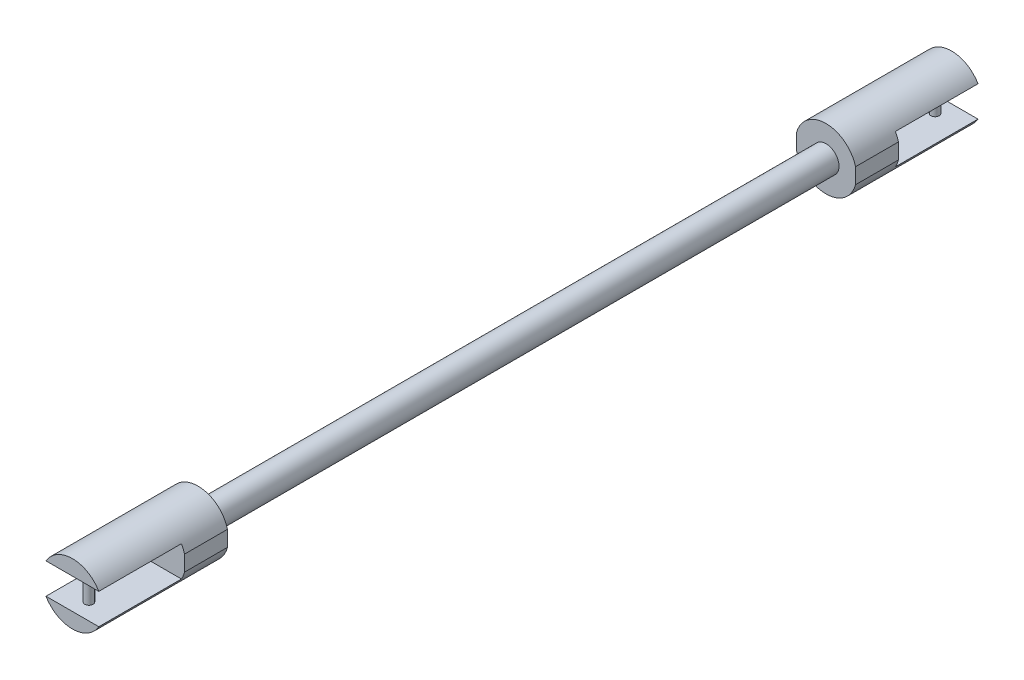
ISO-10303-21;
HEADER;
FILE_DESCRIPTION(('STEP AP214'),'2;1');
FILE_NAME('part.step','',(''),(''),'','','');
FILE_SCHEMA(('AUTOMOTIVE_DESIGN { 1 0 10303 214 1 1 1 1 }'));
ENDSEC;
DATA;
#1=APPLICATION_CONTEXT('core data for automotive mechanical design processes');
#2=APPLICATION_PROTOCOL_DEFINITION('international standard','automotive_design',2000,#1);
#3=PRODUCT_CONTEXT('',#1,'mechanical');
#4=PRODUCT('Part','Part','',(#3));
#5=PRODUCT_RELATED_PRODUCT_CATEGORY('part','',(#4));
#6=PRODUCT_DEFINITION_FORMATION('','',#4);
#7=PRODUCT_DEFINITION_CONTEXT('part definition',#1,'design');
#8=PRODUCT_DEFINITION('design','',#6,#7);
#9=PRODUCT_DEFINITION_SHAPE('','',#8);
#10=(LENGTH_UNIT() NAMED_UNIT(*) SI_UNIT(.MILLI.,.METRE.));
#11=(NAMED_UNIT(*) PLANE_ANGLE_UNIT() SI_UNIT($,.RADIAN.));
#12=(NAMED_UNIT(*) SI_UNIT($,.STERADIAN.) SOLID_ANGLE_UNIT());
#13=UNCERTAINTY_MEASURE_WITH_UNIT(LENGTH_MEASURE(1.E-05),#10,'distance_accuracy_value','');
#14=(GEOMETRIC_REPRESENTATION_CONTEXT(3) GLOBAL_UNCERTAINTY_ASSIGNED_CONTEXT((#13)) GLOBAL_UNIT_ASSIGNED_CONTEXT((#10,
#11,#12)) REPRESENTATION_CONTEXT('',''));
#15=CARTESIAN_POINT('',(0.,0.,0.));
#16=DIRECTION('',(0.,0.,1.));
#17=DIRECTION('',(1.,0.,0.));
#18=AXIS2_PLACEMENT_3D('',#15,#16,#17);
#19=CARTESIAN_POINT('',(0.,0.,-54.864));
#20=DIRECTION('',(0.,0.,-1.));
#21=DIRECTION('',(1.,0.,0.));
#22=AXIS2_PLACEMENT_3D('',#19,#20,#21);
#23=PLANE('',#22);
#24=CARTESIAN_POINT('',(0.,0.,-54.864));
#25=DIRECTION('',(0.,0.,-1.));
#26=DIRECTION('',(-1.,0.,0.));
#27=AXIS2_PLACEMENT_3D('',#24,#25,#26);
#28=CIRCLE('',#27,4.68995455906906);
#29=CARTESIAN_POINT('',(-4.53418049750098,-1.19869970476948,-54.864));
#30=VERTEX_POINT('',#29);
#31=CARTESIAN_POINT('',(-4.05807772117794,-2.35110165135666,-54.864));
#32=VERTEX_POINT('',#31);
#33=EDGE_CURVE('E295',#30,#32,#28,.F.);
#34=ORIENTED_EDGE('',*,*,#33,.F.);
#35=DIRECTION('',(0.,-1.,0.));
#36=VECTOR('',#35,1.);
#37=CARTESIAN_POINT('',(-4.53418049750098,-4.68995455906906,-54.864));
#38=LINE('',#37,#36);
#39=CARTESIAN_POINT('',(-4.53418049750098,1.19869970476948,-54.864));
#40=VERTEX_POINT('',#39);
#41=EDGE_CURVE('E193',#40,#30,#38,.T.);
#42=ORIENTED_EDGE('',*,*,#41,.F.);
#43=CARTESIAN_POINT('',(-4.05807772117794,2.35110165135666,-54.864));
#44=VERTEX_POINT('',#43);
#45=EDGE_CURVE('E290',#44,#40,#28,.F.);
#46=ORIENTED_EDGE('',*,*,#45,.F.);
#47=DIRECTION('',(1.,0.,0.));
#48=VECTOR('',#47,1.);
#49=CARTESIAN_POINT('',(-4.53418049750098,2.35110165135666,-54.864));
#50=LINE('',#49,#48);
#51=CARTESIAN_POINT('',(4.05807772117794,2.35110165135666,-54.864));
#52=VERTEX_POINT('',#51);
#53=EDGE_CURVE('E172',#44,#52,#50,.T.);
#54=ORIENTED_EDGE('',*,*,#53,.T.);
#55=CARTESIAN_POINT('',(4.53418049750098,1.19869970476948,-54.864));
#56=VERTEX_POINT('',#55);
#57=EDGE_CURVE('E163',#56,#52,#28,.F.);
#58=ORIENTED_EDGE('',*,*,#57,.F.);
#59=DIRECTION('',(0.,1.,0.));
#60=VECTOR('',#59,1.);
#61=CARTESIAN_POINT('',(4.53418049750098,-4.68995455906906,-54.864));
#62=LINE('',#61,#60);
#63=CARTESIAN_POINT('',(4.53418049750098,-1.19869970476948,-54.864));
#64=VERTEX_POINT('',#63);
#65=EDGE_CURVE('E190',#64,#56,#62,.T.);
#66=ORIENTED_EDGE('',*,*,#65,.F.);
#67=CARTESIAN_POINT('',(4.05807772117794,-2.35110165135666,-54.864));
#68=VERTEX_POINT('',#67);
#69=EDGE_CURVE('E283',#68,#64,#28,.F.);
#70=ORIENTED_EDGE('',*,*,#69,.F.);
#71=DIRECTION('',(1.,0.,0.));
#72=VECTOR('',#71,1.);
#73=CARTESIAN_POINT('',(-4.53418049750098,-2.35110165135666,-54.864));
#74=LINE('',#73,#72);
#75=EDGE_CURVE('E181',#32,#68,#74,.T.);
#76=ORIENTED_EDGE('',*,*,#75,.F.);
#77=EDGE_LOOP('',(#34,#42,#46,#54,#58,#66,#70,#76));
#78=FACE_BOUND('',#77,.T.);
#79=ADVANCED_FACE('F37',(#78),#23,.T.);
#80=CARTESIAN_POINT('',(0.,0.,-48.26));
#81=DIRECTION('',(0.,0.,-1.));
#82=DIRECTION('',(1.,0.,0.));
#83=AXIS2_PLACEMENT_3D('',#80,#81,#82);
#84=PLANE('',#83);
#85=CARTESIAN_POINT('',(0.,0.,-48.26));
#86=DIRECTION('',(0.,0.,-1.));
#87=DIRECTION('',(-1.,0.,0.));
#88=AXIS2_PLACEMENT_3D('',#85,#86,#87);
#89=CIRCLE('',#88,2.);
#90=CARTESIAN_POINT('',(-2.,0.,-48.26));
#91=VERTEX_POINT('',#90);
#92=EDGE_CURVE('E192',#91,#91,#89,.T.);
#93=ORIENTED_EDGE('',*,*,#92,.T.);
#94=EDGE_LOOP('',(#93));
#95=FACE_BOUND('',#94,.T.);
#96=DIRECTION('',(0.,-1.,0.));
#97=VECTOR('',#96,1.);
#98=CARTESIAN_POINT('',(-4.53418049750098,-4.68995455906906,-48.26));
#99=LINE('',#98,#97);
#100=CARTESIAN_POINT('',(-4.53418049750098,1.19869970476948,-48.26));
#101=VERTEX_POINT('',#100);
#102=CARTESIAN_POINT('',(-4.53418049750098,-1.19869970476948,-48.26));
#103=VERTEX_POINT('',#102);
#104=EDGE_CURVE('E171',#101,#103,#99,.T.);
#105=ORIENTED_EDGE('',*,*,#104,.T.);
#106=CARTESIAN_POINT('',(0.,0.,-48.26));
#107=DIRECTION('',(0.,0.,-1.));
#108=DIRECTION('',(-1.,0.,0.));
#109=AXIS2_PLACEMENT_3D('',#106,#107,#108);
#110=CIRCLE('',#109,4.68995455906906);
#111=CARTESIAN_POINT('',(4.53418049750098,-1.19869970476948,-48.26));
#112=VERTEX_POINT('',#111);
#113=EDGE_CURVE('E298',#103,#112,#110,.F.);
#114=ORIENTED_EDGE('',*,*,#113,.T.);
#115=DIRECTION('',(0.,1.,0.));
#116=VECTOR('',#115,1.);
#117=CARTESIAN_POINT('',(4.53418049750098,-4.68995455906906,-48.26));
#118=LINE('',#117,#116);
#119=CARTESIAN_POINT('',(4.53418049750098,1.19869970476948,-48.26));
#120=VERTEX_POINT('',#119);
#121=EDGE_CURVE('E175',#112,#120,#118,.T.);
#122=ORIENTED_EDGE('',*,*,#121,.T.);
#123=EDGE_CURVE('E286',#120,#101,#110,.F.);
#124=ORIENTED_EDGE('',*,*,#123,.T.);
#125=EDGE_LOOP('',(#105,#114,#122,#124));
#126=FACE_BOUND('',#125,.T.);
#127=ADVANCED_FACE('F328',(#95,#126),#84,.F.);
#128=CARTESIAN_POINT('',(0.,0.,-67.564));
#129=DIRECTION('',(0.,0.,-1.));
#130=DIRECTION('',(1.,0.,0.));
#131=AXIS2_PLACEMENT_3D('',#128,#129,#130);
#132=PLANE('',#131);
#133=CARTESIAN_POINT('',(0.,0.,-67.564));
#134=DIRECTION('',(0.,0.,1.));
#135=DIRECTION('',(1.,0.,0.));
#136=AXIS2_PLACEMENT_3D('',#133,#134,#135);
#137=CIRCLE('',#136,4.68995455906906);
#138=CARTESIAN_POINT('',(4.05807772117794,2.35110165135666,-67.564));
#139=VERTEX_POINT('',#138);
#140=CARTESIAN_POINT('',(-4.05807772117794,2.35110165135666,-67.564));
#141=VERTEX_POINT('',#140);
#142=EDGE_CURVE('E149',#139,#141,#137,.T.);
#143=ORIENTED_EDGE('',*,*,#142,.F.);
#144=DIRECTION('',(1.,0.,0.));
#145=VECTOR('',#144,1.);
#146=CARTESIAN_POINT('',(-4.53418049750098,2.35110165135666,-67.564));
#147=LINE('',#146,#145);
#148=EDGE_CURVE('E153',#141,#139,#147,.T.);
#149=ORIENTED_EDGE('',*,*,#148,.F.);
#150=EDGE_LOOP('',(#143,#149));
#151=FACE_BOUND('',#150,.T.);
#152=ADVANCED_FACE('F151',(#151),#132,.T.);
#153=CARTESIAN_POINT('',(0.,0.,-67.564));
#154=DIRECTION('',(0.,0.,-1.));
#155=DIRECTION('',(1.,0.,0.));
#156=AXIS2_PLACEMENT_3D('',#153,#154,#155);
#157=PLANE('',#156);
#158=CARTESIAN_POINT('',(0.,0.,-67.564));
#159=DIRECTION('',(0.,0.,-1.));
#160=DIRECTION('',(-1.,0.,0.));
#161=AXIS2_PLACEMENT_3D('',#158,#159,#160);
#162=CIRCLE('',#161,4.68995455906906);
#163=CARTESIAN_POINT('',(-4.05807772117794,-2.35110165135666,-67.564));
#164=VERTEX_POINT('',#163);
#165=CARTESIAN_POINT('',(4.05807772117794,-2.35110165135666,-67.564));
#166=VERTEX_POINT('',#165);
#167=EDGE_CURVE('E45',#164,#166,#162,.F.);
#168=ORIENTED_EDGE('',*,*,#167,.F.);
#169=DIRECTION('',(1.,0.,0.));
#170=VECTOR('',#169,1.);
#171=CARTESIAN_POINT('',(-4.53418049750098,-2.35110165135666,-67.564));
#172=LINE('',#171,#170);
#173=EDGE_CURVE('E177',#164,#166,#172,.T.);
#174=ORIENTED_EDGE('',*,*,#173,.T.);
#175=EDGE_LOOP('',(#168,#174));
#176=FACE_BOUND('',#175,.T.);
#177=ADVANCED_FACE('F285',(#176),#157,.T.);
#178=CARTESIAN_POINT('',(-4.53418049750098,-4.68995455906906,54.864));
#179=DIRECTION('',(1.,0.,0.));
#180=DIRECTION('',(0.,0.,-1.));
#181=AXIS2_PLACEMENT_3D('',#178,#179,#180);
#182=PLANE('',#181);
#183=DIRECTION('',(0.,0.,1.));
#184=VECTOR('',#183,1.);
#185=CARTESIAN_POINT('',(-4.53418049750098,1.19869970476948,0.));
#186=LINE('',#185,#184);
#187=CARTESIAN_POINT('',(-4.53418049750098,1.19869970476948,48.26));
#188=VERTEX_POINT('',#187);
#189=CARTESIAN_POINT('',(-4.53418049750098,1.19869970476948,54.864));
#190=VERTEX_POINT('',#189);
#191=EDGE_CURVE('E227',#188,#190,#186,.T.);
#192=ORIENTED_EDGE('',*,*,#191,.F.);
#193=DIRECTION('',(0.,-1.,0.));
#194=VECTOR('',#193,1.);
#195=CARTESIAN_POINT('',(-4.53418049750098,-4.68995455906906,48.26));
#196=LINE('',#195,#194);
#197=CARTESIAN_POINT('',(-4.53418049750098,-1.19869970476948,48.26));
#198=VERTEX_POINT('',#197);
#199=EDGE_CURVE('E239',#188,#198,#196,.T.);
#200=ORIENTED_EDGE('',*,*,#199,.T.);
#201=DIRECTION('',(0.,0.,1.));
#202=VECTOR('',#201,1.);
#203=CARTESIAN_POINT('',(-4.53418049750098,-1.19869970476948,0.));
#204=LINE('',#203,#202);
#205=CARTESIAN_POINT('',(-4.53418049750098,-1.19869970476948,54.864));
#206=VERTEX_POINT('',#205);
#207=EDGE_CURVE('E217',#206,#198,#204,.F.);
#208=ORIENTED_EDGE('',*,*,#207,.F.);
#209=DIRECTION('',(0.,-1.,0.));
#210=VECTOR('',#209,1.);
#211=CARTESIAN_POINT('',(-4.53418049750098,-4.68995455906906,54.864));
#212=LINE('',#211,#210);
#213=EDGE_CURVE('E254',#190,#206,#212,.T.);
#214=ORIENTED_EDGE('',*,*,#213,.F.);
#215=EDGE_LOOP('',(#192,#200,#208,#214));
#216=FACE_BOUND('',#215,.T.);
#217=ADVANCED_FACE('F372',(#216),#182,.F.);
#218=CARTESIAN_POINT('',(4.53418049750098,-4.68995455906906,54.864));
#219=DIRECTION('',(-1.,0.,0.));
#220=DIRECTION('',(0.,0.,1.));
#221=AXIS2_PLACEMENT_3D('',#218,#219,#220);
#222=PLANE('',#221);
#223=DIRECTION('',(0.,0.,1.));
#224=VECTOR('',#223,1.);
#225=CARTESIAN_POINT('',(4.53418049750098,-1.19869970476948,0.));
#226=LINE('',#225,#224);
#227=CARTESIAN_POINT('',(4.53418049750098,-1.19869970476948,48.26));
#228=VERTEX_POINT('',#227);
#229=CARTESIAN_POINT('',(4.53418049750098,-1.19869970476948,54.864));
#230=VERTEX_POINT('',#229);
#231=EDGE_CURVE('E209',#228,#230,#226,.T.);
#232=ORIENTED_EDGE('',*,*,#231,.F.);
#233=DIRECTION('',(0.,1.,0.));
#234=VECTOR('',#233,1.);
#235=CARTESIAN_POINT('',(4.53418049750098,-4.68995455906906,48.26));
#236=LINE('',#235,#234);
#237=CARTESIAN_POINT('',(4.53418049750098,1.19869970476948,48.26));
#238=VERTEX_POINT('',#237);
#239=EDGE_CURVE('E259',#228,#238,#236,.T.);
#240=ORIENTED_EDGE('',*,*,#239,.T.);
#241=DIRECTION('',(0.,0.,1.));
#242=VECTOR('',#241,1.);
#243=CARTESIAN_POINT('',(4.53418049750098,1.19869970476948,0.));
#244=LINE('',#243,#242);
#245=CARTESIAN_POINT('',(4.53418049750098,1.19869970476948,54.864));
#246=VERTEX_POINT('',#245);
#247=EDGE_CURVE('E216',#246,#238,#244,.F.);
#248=ORIENTED_EDGE('',*,*,#247,.F.);
#249=DIRECTION('',(0.,1.,0.));
#250=VECTOR('',#249,1.);
#251=CARTESIAN_POINT('',(4.53418049750098,-4.68995455906906,54.864));
#252=LINE('',#251,#250);
#253=EDGE_CURVE('E250',#230,#246,#252,.T.);
#254=ORIENTED_EDGE('',*,*,#253,.F.);
#255=EDGE_LOOP('',(#232,#240,#248,#254));
#256=FACE_BOUND('',#255,.T.);
#257=ADVANCED_FACE('F367',(#256),#222,.F.);
#258=CARTESIAN_POINT('',(0.,0.,54.864));
#259=DIRECTION('',(0.,0.,1.));
#260=DIRECTION('',(1.,0.,0.));
#261=AXIS2_PLACEMENT_3D('',#258,#259,#260);
#262=PLANE('',#261);
#263=ORIENTED_EDGE('',*,*,#253,.T.);
#264=CARTESIAN_POINT('',(0.,0.,54.864));
#265=DIRECTION('',(0.,0.,1.));
#266=DIRECTION('',(1.,0.,0.));
#267=AXIS2_PLACEMENT_3D('',#264,#265,#266);
#268=CIRCLE('',#267,4.68995455906906);
#269=CARTESIAN_POINT('',(4.05807772117794,2.35110165135666,54.864));
#270=VERTEX_POINT('',#269);
#271=EDGE_CURVE('E224',#246,#270,#268,.T.);
#272=ORIENTED_EDGE('',*,*,#271,.T.);
#273=DIRECTION('',(1.,0.,0.));
#274=VECTOR('',#273,1.);
#275=CARTESIAN_POINT('',(-4.53418049750098,2.35110165135666,54.864));
#276=LINE('',#275,#274);
#277=CARTESIAN_POINT('',(-4.05807772117794,2.35110165135666,54.864));
#278=VERTEX_POINT('',#277);
#279=EDGE_CURVE('E233',#278,#270,#276,.T.);
#280=ORIENTED_EDGE('',*,*,#279,.F.);
#281=EDGE_CURVE('E210',#278,#190,#268,.T.);
#282=ORIENTED_EDGE('',*,*,#281,.T.);
#283=ORIENTED_EDGE('',*,*,#213,.T.);
#284=CARTESIAN_POINT('',(-4.05807772117794,-2.35110165135666,54.864));
#285=VERTEX_POINT('',#284);
#286=EDGE_CURVE('E211',#206,#285,#268,.T.);
#287=ORIENTED_EDGE('',*,*,#286,.T.);
#288=DIRECTION('',(1.,0.,0.));
#289=VECTOR('',#288,1.);
#290=CARTESIAN_POINT('',(-4.53418049750098,-2.35110165135666,54.864));
#291=LINE('',#290,#289);
#292=CARTESIAN_POINT('',(4.05807772117794,-2.35110165135666,54.864));
#293=VERTEX_POINT('',#292);
#294=EDGE_CURVE('E229',#285,#293,#291,.T.);
#295=ORIENTED_EDGE('',*,*,#294,.T.);
#296=EDGE_CURVE('E206',#293,#230,#268,.T.);
#297=ORIENTED_EDGE('',*,*,#296,.T.);
#298=EDGE_LOOP('',(#263,#272,#280,#282,#283,#287,#295,#297));
#299=FACE_BOUND('',#298,.T.);
#300=ADVANCED_FACE('F364',(#299),#262,.T.);
#301=CARTESIAN_POINT('',(0.,0.,48.26));
#302=DIRECTION('',(0.,0.,1.));
#303=DIRECTION('',(1.,0.,0.));
#304=AXIS2_PLACEMENT_3D('',#301,#302,#303);
#305=PLANE('',#304);
#306=CARTESIAN_POINT('',(0.,0.,48.26));
#307=DIRECTION('',(0.,0.,1.));
#308=DIRECTION('',(1.,0.,0.));
#309=AXIS2_PLACEMENT_3D('',#306,#307,#308);
#310=CIRCLE('',#309,2.);
#311=CARTESIAN_POINT('',(-2.,0.,48.26));
#312=VERTEX_POINT('',#311);
#313=EDGE_CURVE('E253',#312,#312,#310,.T.);
#314=ORIENTED_EDGE('',*,*,#313,.T.);
#315=EDGE_LOOP('',(#314));
#316=FACE_BOUND('',#315,.T.);
#317=CARTESIAN_POINT('',(0.,0.,48.26));
#318=DIRECTION('',(0.,0.,1.));
#319=DIRECTION('',(1.,0.,0.));
#320=AXIS2_PLACEMENT_3D('',#317,#318,#319);
#321=CIRCLE('',#320,4.68995455906906);
#322=EDGE_CURVE('E214',#238,#188,#321,.T.);
#323=ORIENTED_EDGE('',*,*,#322,.F.);
#324=ORIENTED_EDGE('',*,*,#239,.F.);
#325=EDGE_CURVE('E213',#198,#228,#321,.T.);
#326=ORIENTED_EDGE('',*,*,#325,.F.);
#327=ORIENTED_EDGE('',*,*,#199,.F.);
#328=EDGE_LOOP('',(#323,#324,#326,#327));
#329=FACE_BOUND('',#328,.T.);
#330=ADVANCED_FACE('F362',(#316,#329),#305,.F.);
#331=CARTESIAN_POINT('',(-4.53418049750098,2.35110165135666,67.564));
#332=DIRECTION('',(0.,1.,0.));
#333=DIRECTION('',(0.,0.,1.));
#334=AXIS2_PLACEMENT_3D('',#331,#332,#333);
#335=PLANE('',#334);
#336=CARTESIAN_POINT('',(0.,2.35110165135666,65.024));
#337=DIRECTION('',(0.,1.,0.));
#338=DIRECTION('',(0.,0.,1.));
#339=AXIS2_PLACEMENT_3D('',#336,#337,#338);
#340=CIRCLE('',#339,0.635000000000002);
#341=CARTESIAN_POINT('',(0.,2.35110165135666,65.659));
#342=VERTEX_POINT('',#341);
#343=EDGE_CURVE('E264',#342,#342,#340,.F.);
#344=ORIENTED_EDGE('',*,*,#343,.F.);
#345=EDGE_LOOP('',(#344));
#346=FACE_BOUND('',#345,.T.);
#347=DIRECTION('',(0.,0.,1.));
#348=VECTOR('',#347,1.);
#349=CARTESIAN_POINT('',(-4.05807772117794,2.35110165135666,0.));
#350=LINE('',#349,#348);
#351=CARTESIAN_POINT('',(-4.05807772117794,2.35110165135666,67.564));
#352=VERTEX_POINT('',#351);
#353=EDGE_CURVE('E52',#278,#352,#350,.T.);
#354=ORIENTED_EDGE('',*,*,#353,.F.);
#355=ORIENTED_EDGE('',*,*,#279,.T.);
#356=DIRECTION('',(0.,0.,1.));
#357=VECTOR('',#356,1.);
#358=CARTESIAN_POINT('',(4.05807772117794,2.35110165135666,0.));
#359=LINE('',#358,#357);
#360=CARTESIAN_POINT('',(4.05807772117794,2.35110165135666,67.564));
#361=VERTEX_POINT('',#360);
#362=EDGE_CURVE('E222',#361,#270,#359,.F.);
#363=ORIENTED_EDGE('',*,*,#362,.F.);
#364=DIRECTION('',(1.,0.,0.));
#365=VECTOR('',#364,1.);
#366=CARTESIAN_POINT('',(-4.53418049750098,2.35110165135666,67.564));
#367=LINE('',#366,#365);
#368=EDGE_CURVE('E236',#352,#361,#367,.T.);
#369=ORIENTED_EDGE('',*,*,#368,.F.);
#370=EDGE_LOOP('',(#354,#355,#363,#369));
#371=FACE_BOUND('',#370,.T.);
#372=ADVANCED_FACE('F358',(#346,#371),#335,.F.);
#373=CARTESIAN_POINT('',(0.,0.,67.564));
#374=DIRECTION('',(0.,0.,1.));
#375=DIRECTION('',(1.,0.,0.));
#376=AXIS2_PLACEMENT_3D('',#373,#374,#375);
#377=PLANE('',#376);
#378=ORIENTED_EDGE('',*,*,#368,.T.);
#379=CARTESIAN_POINT('',(0.,0.,67.564));
#380=DIRECTION('',(0.,0.,1.));
#381=DIRECTION('',(1.,0.,0.));
#382=AXIS2_PLACEMENT_3D('',#379,#380,#381);
#383=CIRCLE('',#382,4.68995455906906);
#384=EDGE_CURVE('E203',#361,#352,#383,.T.);
#385=ORIENTED_EDGE('',*,*,#384,.T.);
#386=EDGE_LOOP('',(#378,#385));
#387=FACE_BOUND('',#386,.T.);
#388=ADVANCED_FACE('F354',(#387),#377,.T.);
#389=CARTESIAN_POINT('',(-4.53418049750098,-2.35110165135666,67.564));
#390=DIRECTION('',(0.,1.,0.));
#391=DIRECTION('',(0.,0.,1.));
#392=AXIS2_PLACEMENT_3D('',#389,#390,#391);
#393=PLANE('',#392);
#394=CARTESIAN_POINT('',(0.,-2.35110165135666,65.024));
#395=DIRECTION('',(0.,1.,0.));
#396=DIRECTION('',(0.,0.,1.));
#397=AXIS2_PLACEMENT_3D('',#394,#395,#396);
#398=CIRCLE('',#397,0.635000000000002);
#399=CARTESIAN_POINT('',(0.,-2.35110165135666,65.659));
#400=VERTEX_POINT('',#399);
#401=EDGE_CURVE('E200',#400,#400,#398,.T.);
#402=ORIENTED_EDGE('',*,*,#401,.F.);
#403=EDGE_LOOP('',(#402));
#404=FACE_BOUND('',#403,.T.);
#405=ORIENTED_EDGE('',*,*,#294,.F.);
#406=DIRECTION('',(0.,0.,1.));
#407=VECTOR('',#406,1.);
#408=CARTESIAN_POINT('',(-4.05807772117794,-2.35110165135666,0.));
#409=LINE('',#408,#407);
#410=CARTESIAN_POINT('',(-4.05807772117794,-2.35110165135666,67.564));
#411=VERTEX_POINT('',#410);
#412=EDGE_CURVE('E219',#285,#411,#409,.T.);
#413=ORIENTED_EDGE('',*,*,#412,.T.);
#414=DIRECTION('',(1.,0.,0.));
#415=VECTOR('',#414,1.);
#416=CARTESIAN_POINT('',(-4.53418049750098,-2.35110165135666,67.564));
#417=LINE('',#416,#415);
#418=CARTESIAN_POINT('',(4.05807772117794,-2.35110165135666,67.564));
#419=VERTEX_POINT('',#418);
#420=EDGE_CURVE('E230',#411,#419,#417,.T.);
#421=ORIENTED_EDGE('',*,*,#420,.T.);
#422=DIRECTION('',(0.,0.,1.));
#423=VECTOR('',#422,1.);
#424=CARTESIAN_POINT('',(4.05807772117794,-2.35110165135666,0.));
#425=LINE('',#424,#423);
#426=EDGE_CURVE('E60',#419,#293,#425,.F.);
#427=ORIENTED_EDGE('',*,*,#426,.T.);
#428=EDGE_LOOP('',(#405,#413,#421,#427));
#429=FACE_BOUND('',#428,.T.);
#430=ADVANCED_FACE('F351',(#404,#429),#393,.T.);
#431=CARTESIAN_POINT('',(0.,0.,67.564));
#432=DIRECTION('',(0.,0.,1.));
#433=DIRECTION('',(1.,0.,0.));
#434=AXIS2_PLACEMENT_3D('',#431,#432,#433);
#435=PLANE('',#434);
#436=ORIENTED_EDGE('',*,*,#420,.F.);
#437=CARTESIAN_POINT('',(0.,0.,67.564));
#438=DIRECTION('',(0.,0.,1.));
#439=DIRECTION('',(1.,0.,0.));
#440=AXIS2_PLACEMENT_3D('',#437,#438,#439);
#441=CIRCLE('',#440,4.68995455906906);
#442=EDGE_CURVE('E248',#411,#419,#441,.T.);
#443=ORIENTED_EDGE('',*,*,#442,.T.);
#444=EDGE_LOOP('',(#436,#443));
#445=FACE_BOUND('',#444,.T.);
#446=ADVANCED_FACE('F348',(#445),#435,.T.);
#447=CARTESIAN_POINT('',(0.,0.,48.26));
#448=DIRECTION('',(0.,0.,-1.));
#449=DIRECTION('',(-1.,0.,0.));
#450=AXIS2_PLACEMENT_3D('',#447,#448,#449);
#451=CYLINDRICAL_SURFACE('',#450,2.);
#452=CARTESIAN_POINT('',(-2.,0.,48.26));
#453=CARTESIAN_POINT('',(-2.,0.,47.2545833333333));
#454=CARTESIAN_POINT('',(-2.,0.,46.2491666666667));
#455=CARTESIAN_POINT('',(-2.,0.,44.2383333333333));
#456=CARTESIAN_POINT('',(-2.,0.,43.2329166666667));
#457=CARTESIAN_POINT('',(-2.,0.,41.2220833333333));
#458=CARTESIAN_POINT('',(-2.,0.,40.2166666666667));
#459=CARTESIAN_POINT('',(-2.,0.,38.2058333333333));
#460=CARTESIAN_POINT('',(-2.,0.,37.2004166666667));
#461=CARTESIAN_POINT('',(-2.,0.,35.1895833333333));
#462=CARTESIAN_POINT('',(-2.,0.,34.1841666666667));
#463=CARTESIAN_POINT('',(-2.,0.,32.1733333333333));
#464=CARTESIAN_POINT('',(-2.,0.,31.1679166666667));
#465=CARTESIAN_POINT('',(-2.,0.,29.1570833333333));
#466=CARTESIAN_POINT('',(-2.,0.,28.1516666666667));
#467=CARTESIAN_POINT('',(-2.,0.,26.1408333333333));
#468=CARTESIAN_POINT('',(-2.,0.,25.1354166666667));
#469=CARTESIAN_POINT('',(-2.,0.,23.1245833333333));
#470=CARTESIAN_POINT('',(-2.,0.,22.1191666666667));
#471=CARTESIAN_POINT('',(-2.,0.,20.1083333333333));
#472=CARTESIAN_POINT('',(-2.,0.,19.1029166666667));
#473=CARTESIAN_POINT('',(-2.,0.,17.0920833333333));
#474=CARTESIAN_POINT('',(-2.,0.,16.0866666666667));
#475=CARTESIAN_POINT('',(-2.,0.,14.0758333333333));
#476=CARTESIAN_POINT('',(-2.,0.,13.0704166666667));
#477=CARTESIAN_POINT('',(-2.,0.,11.0595833333333));
#478=CARTESIAN_POINT('',(-2.,0.,10.0541666666667));
#479=CARTESIAN_POINT('',(-2.,0.,8.04333333333334));
#480=CARTESIAN_POINT('',(-2.,0.,7.03791666666667));
#481=CARTESIAN_POINT('',(-2.,0.,5.02708333333334));
#482=CARTESIAN_POINT('',(-2.,0.,4.02166666666667));
#483=CARTESIAN_POINT('',(-2.,0.,2.01083333333334));
#484=CARTESIAN_POINT('',(-2.,0.,1.00541666666667));
#485=CARTESIAN_POINT('',(-2.,0.,-1.00541666666666));
#486=CARTESIAN_POINT('',(-2.,0.,-2.01083333333333));
#487=CARTESIAN_POINT('',(-2.,0.,-4.02166666666666));
#488=CARTESIAN_POINT('',(-2.,0.,-5.02708333333332));
#489=CARTESIAN_POINT('',(-2.,0.,-7.03791666666666));
#490=CARTESIAN_POINT('',(-2.,0.,-8.04333333333333));
#491=CARTESIAN_POINT('',(-2.,0.,-10.0541666666667));
#492=CARTESIAN_POINT('',(-2.,0.,-11.0595833333333));
#493=CARTESIAN_POINT('',(-2.,0.,-13.0704166666667));
#494=CARTESIAN_POINT('',(-2.,0.,-14.0758333333333));
#495=CARTESIAN_POINT('',(-2.,0.,-16.0866666666667));
#496=CARTESIAN_POINT('',(-2.,0.,-17.0920833333333));
#497=CARTESIAN_POINT('',(-2.,0.,-19.1029166666667));
#498=CARTESIAN_POINT('',(-2.,0.,-20.1083333333333));
#499=CARTESIAN_POINT('',(-2.,0.,-22.1191666666667));
#500=CARTESIAN_POINT('',(-2.,0.,-23.1245833333333));
#501=CARTESIAN_POINT('',(-2.,0.,-25.1354166666667));
#502=CARTESIAN_POINT('',(-2.,0.,-26.1408333333333));
#503=CARTESIAN_POINT('',(-2.,0.,-28.1516666666666));
#504=CARTESIAN_POINT('',(-2.,0.,-29.1570833333333));
#505=CARTESIAN_POINT('',(-2.,0.,-31.1679166666666));
#506=CARTESIAN_POINT('',(-2.,0.,-32.1733333333333));
#507=CARTESIAN_POINT('',(-2.,0.,-34.1841666666666));
#508=CARTESIAN_POINT('',(-2.,0.,-35.1895833333333));
#509=CARTESIAN_POINT('',(-2.,0.,-37.2004166666667));
#510=CARTESIAN_POINT('',(-2.,0.,-38.2058333333333));
#511=CARTESIAN_POINT('',(-2.,0.,-40.2166666666667));
#512=CARTESIAN_POINT('',(-2.,0.,-41.2220833333333));
#513=CARTESIAN_POINT('',(-2.,0.,-43.2329166666667));
#514=CARTESIAN_POINT('',(-2.,0.,-44.2383333333333));
#515=CARTESIAN_POINT('',(-2.,0.,-46.2491666666667));
#516=CARTESIAN_POINT('',(-2.,0.,-47.2545833333333));
#517=CARTESIAN_POINT('',(-2.,0.,-48.26));
#518=B_SPLINE_CURVE_WITH_KNOTS('',3,(#452,#453,#454,#455,#456,#457,#458,#459,#460,#461,#462,
#463,#464,#465,#466,#467,#468,#469,#470,#471,#472,#473,#474,#475,#476,#477,#478,#479,#480,#481,
#482,#483,#484,#485,#486,#487,#488,#489,#490,#491,#492,#493,#494,#495,#496,#497,#498,#499,#500,
#501,#502,#503,#504,#505,#506,#507,#508,#509,#510,#511,#512,#513,#514,#515,#516,#517),
.UNSPECIFIED.,.F.,.F.,(4,2,2,2,2,2,2,2,2,2,2,2,2,2,2,2,2,2,2,2,2,2,2,2,2,2,2,2,2,2,2,2,4),(0.,
3.01625000000001,6.0325,9.04875,12.065,15.08125,18.0975,21.11375,24.13,27.14625,30.1625,
33.17875,36.195,39.21125,42.2275,45.24375,48.26,51.27625,54.2925,57.30875,60.325,63.34125,
66.3575,69.37375,72.39,75.40625,78.4225,81.43875,84.455,87.47125,90.4875,93.50375,96.52),.UNSPECIFIED.);
#519=EDGE_CURVE('BSEAM39',#312,#91,#518,.T.);
#520=ORIENTED_EDGE('',*,*,#313,.F.);
#521=ORIENTED_EDGE('',*,*,#92,.F.);
#522=ORIENTED_EDGE('',*,*,#519,.T.);
#523=ORIENTED_EDGE('',*,*,#519,.F.);
#524=EDGE_LOOP('',(#520,#522,#521,#523));
#525=FACE_BOUND('',#524,.T.);
#526=ADVANCED_FACE('F39',(#525),#451,.T.);
#527=CARTESIAN_POINT('',(0.,0.,0.));
#528=DIRECTION('',(0.,0.,1.));
#529=DIRECTION('',(1.,0.,0.));
#530=AXIS2_PLACEMENT_3D('',#527,#528,#529);
#531=CYLINDRICAL_SURFACE('',#530,4.68995455906906);
#532=ORIENTED_EDGE('',*,*,#325,.T.);
#533=ORIENTED_EDGE('',*,*,#231,.T.);
#534=ORIENTED_EDGE('',*,*,#296,.F.);
#535=ORIENTED_EDGE('',*,*,#426,.F.);
#536=ORIENTED_EDGE('',*,*,#442,.F.);
#537=ORIENTED_EDGE('',*,*,#412,.F.);
#538=ORIENTED_EDGE('',*,*,#286,.F.);
#539=ORIENTED_EDGE('',*,*,#207,.T.);
#540=EDGE_LOOP('',(#532,#533,#534,#535,#536,#537,#538,#539));
#541=FACE_BOUND('',#540,.T.);
#542=ADVANCED_FACE('F345',(#541),#531,.T.);
#543=ORIENTED_EDGE('',*,*,#322,.T.);
#544=ORIENTED_EDGE('',*,*,#191,.T.);
#545=ORIENTED_EDGE('',*,*,#281,.F.);
#546=ORIENTED_EDGE('',*,*,#353,.T.);
#547=ORIENTED_EDGE('',*,*,#384,.F.);
#548=ORIENTED_EDGE('',*,*,#362,.T.);
#549=ORIENTED_EDGE('',*,*,#271,.F.);
#550=ORIENTED_EDGE('',*,*,#247,.T.);
#551=EDGE_LOOP('',(#543,#544,#545,#546,#547,#548,#549,#550));
#552=FACE_BOUND('',#551,.T.);
#553=ADVANCED_FACE('F343',(#552),#531,.T.);
#554=CARTESIAN_POINT('',(0.,4.14715287557049,65.024));
#555=DIRECTION('',(0.,-1.,0.));
#556=DIRECTION('',(0.,0.,-1.));
#557=AXIS2_PLACEMENT_3D('',#554,#555,#556);
#558=CYLINDRICAL_SURFACE('',#557,0.635000000000002);
#559=ORIENTED_EDGE('',*,*,#401,.T.);
#560=EDGE_LOOP('',(#559));
#561=FACE_BOUND('',#560,.T.);
#562=ORIENTED_EDGE('',*,*,#343,.T.);
#563=EDGE_LOOP('',(#562));
#564=FACE_BOUND('',#563,.T.);
#565=ADVANCED_FACE('F339',(#561,#564),#558,.T.);
#566=CARTESIAN_POINT('',(-4.53418049750098,-4.68995455906906,-54.864));
#567=DIRECTION('',(-1.,0.,0.));
#568=DIRECTION('',(0.,0.,1.));
#569=AXIS2_PLACEMENT_3D('',#566,#567,#568);
#570=PLANE('',#569);
#571=DIRECTION('',(0.,0.,-1.));
#572=VECTOR('',#571,1.);
#573=CARTESIAN_POINT('',(-4.53418049750098,1.19869970476948,67.564));
#574=LINE('',#573,#572);
#575=EDGE_CURVE('E288',#40,#101,#574,.F.);
#576=ORIENTED_EDGE('',*,*,#575,.F.);
#577=ORIENTED_EDGE('',*,*,#41,.T.);
#578=DIRECTION('',(0.,0.,-1.));
#579=VECTOR('',#578,1.);
#580=CARTESIAN_POINT('',(-4.53418049750098,-1.19869970476948,67.564));
#581=LINE('',#580,#579);
#582=EDGE_CURVE('E296',#103,#30,#581,.T.);
#583=ORIENTED_EDGE('',*,*,#582,.F.);
#584=ORIENTED_EDGE('',*,*,#104,.F.);
#585=EDGE_LOOP('',(#576,#577,#583,#584));
#586=FACE_BOUND('',#585,.T.);
#587=ADVANCED_FACE('F322',(#586),#570,.T.);
#588=CARTESIAN_POINT('',(4.53418049750098,-4.68995455906906,-54.864));
#589=DIRECTION('',(1.,0.,0.));
#590=DIRECTION('',(0.,0.,-1.));
#591=AXIS2_PLACEMENT_3D('',#588,#589,#590);
#592=PLANE('',#591);
#593=DIRECTION('',(0.,0.,-1.));
#594=VECTOR('',#593,1.);
#595=CARTESIAN_POINT('',(4.53418049750098,-1.19869970476948,67.564));
#596=LINE('',#595,#594);
#597=EDGE_CURVE('E301',#64,#112,#596,.F.);
#598=ORIENTED_EDGE('',*,*,#597,.F.);
#599=ORIENTED_EDGE('',*,*,#65,.T.);
#600=DIRECTION('',(0.,0.,-1.));
#601=VECTOR('',#600,1.);
#602=CARTESIAN_POINT('',(4.53418049750098,1.19869970476948,67.564));
#603=LINE('',#602,#601);
#604=EDGE_CURVE('E292',#120,#56,#603,.T.);
#605=ORIENTED_EDGE('',*,*,#604,.F.);
#606=ORIENTED_EDGE('',*,*,#121,.F.);
#607=EDGE_LOOP('',(#598,#599,#605,#606));
#608=FACE_BOUND('',#607,.T.);
#609=ADVANCED_FACE('F315',(#608),#592,.T.);
#610=CARTESIAN_POINT('',(-4.53418049750098,2.35110165135666,-67.564));
#611=DIRECTION('',(0.,-1.,0.));
#612=DIRECTION('',(0.,0.,-1.));
#613=AXIS2_PLACEMENT_3D('',#610,#611,#612);
#614=PLANE('',#613);
#615=CARTESIAN_POINT('',(0.,2.35110165135666,-65.024));
#616=DIRECTION('',(0.,-1.,0.));
#617=DIRECTION('',(0.,0.,-1.));
#618=AXIS2_PLACEMENT_3D('',#615,#616,#617);
#619=CIRCLE('',#618,0.635000000000002);
#620=CARTESIAN_POINT('',(0.,2.35110165135666,-65.659));
#621=VERTEX_POINT('',#620);
#622=EDGE_CURVE('E12',#621,#621,#619,.T.);
#623=ORIENTED_EDGE('',*,*,#622,.F.);
#624=EDGE_LOOP('',(#623));
#625=FACE_BOUND('',#624,.T.);
#626=DIRECTION('',(0.,0.,-1.));
#627=VECTOR('',#626,1.);
#628=CARTESIAN_POINT('',(-4.05807772117794,2.35110165135666,67.564));
#629=LINE('',#628,#627);
#630=EDGE_CURVE('E170',#141,#44,#629,.F.);
#631=ORIENTED_EDGE('',*,*,#630,.F.);
#632=ORIENTED_EDGE('',*,*,#148,.T.);
#633=DIRECTION('',(0.,0.,-1.));
#634=VECTOR('',#633,1.);
#635=CARTESIAN_POINT('',(4.05807772117794,2.35110165135666,67.564));
#636=LINE('',#635,#634);
#637=EDGE_CURVE('E160',#52,#139,#636,.T.);
#638=ORIENTED_EDGE('',*,*,#637,.F.);
#639=ORIENTED_EDGE('',*,*,#53,.F.);
#640=EDGE_LOOP('',(#631,#632,#638,#639));
#641=FACE_BOUND('',#640,.T.);
#642=ADVANCED_FACE('F169',(#625,#641),#614,.T.);
#643=CARTESIAN_POINT('',(-4.53418049750098,-2.35110165135666,-67.564));
#644=DIRECTION('',(0.,-1.,0.));
#645=DIRECTION('',(0.,0.,-1.));
#646=AXIS2_PLACEMENT_3D('',#643,#644,#645);
#647=PLANE('',#646);
#648=CARTESIAN_POINT('',(0.,-2.35110165135666,-65.024));
#649=DIRECTION('',(0.,-1.,0.));
#650=DIRECTION('',(0.,0.,-1.));
#651=AXIS2_PLACEMENT_3D('',#648,#649,#650);
#652=CIRCLE('',#651,0.635000000000002);
#653=CARTESIAN_POINT('',(0.,-2.35110165135666,-65.659));
#654=VERTEX_POINT('',#653);
#655=EDGE_CURVE('E157',#654,#654,#652,.T.);
#656=ORIENTED_EDGE('',*,*,#655,.T.);
#657=EDGE_LOOP('',(#656));
#658=FACE_BOUND('',#657,.T.);
#659=ORIENTED_EDGE('',*,*,#173,.F.);
#660=DIRECTION('',(0.,0.,-1.));
#661=VECTOR('',#660,1.);
#662=CARTESIAN_POINT('',(-4.05807772117794,-2.35110165135666,67.564));
#663=LINE('',#662,#661);
#664=EDGE_CURVE('E167',#164,#32,#663,.F.);
#665=ORIENTED_EDGE('',*,*,#664,.T.);
#666=ORIENTED_EDGE('',*,*,#75,.T.);
#667=DIRECTION('',(0.,0.,-1.));
#668=VECTOR('',#667,1.);
#669=CARTESIAN_POINT('',(4.05807772117794,-2.35110165135666,67.564));
#670=LINE('',#669,#668);
#671=EDGE_CURVE('E156',#68,#166,#670,.T.);
#672=ORIENTED_EDGE('',*,*,#671,.T.);
#673=EDGE_LOOP('',(#659,#665,#666,#672));
#674=FACE_BOUND('',#673,.T.);
#675=ADVANCED_FACE('F281',(#658,#674),#647,.F.);
#676=CARTESIAN_POINT('',(0.,0.,67.564));
#677=DIRECTION('',(0.,0.,-1.));
#678=DIRECTION('',(-1.,0.,0.));
#679=AXIS2_PLACEMENT_3D('',#676,#677,#678);
#680=CYLINDRICAL_SURFACE('',#679,4.68995455906906);
#681=ORIENTED_EDGE('',*,*,#167,.T.);
#682=ORIENTED_EDGE('',*,*,#671,.F.);
#683=ORIENTED_EDGE('',*,*,#69,.T.);
#684=ORIENTED_EDGE('',*,*,#597,.T.);
#685=ORIENTED_EDGE('',*,*,#113,.F.);
#686=ORIENTED_EDGE('',*,*,#582,.T.);
#687=ORIENTED_EDGE('',*,*,#33,.T.);
#688=ORIENTED_EDGE('',*,*,#664,.F.);
#689=EDGE_LOOP('',(#681,#682,#683,#684,#685,#686,#687,#688));
#690=FACE_BOUND('',#689,.T.);
#691=ADVANCED_FACE('F273',(#690),#680,.T.);
#692=ORIENTED_EDGE('',*,*,#123,.F.);
#693=ORIENTED_EDGE('',*,*,#604,.T.);
#694=ORIENTED_EDGE('',*,*,#57,.T.);
#695=ORIENTED_EDGE('',*,*,#637,.T.);
#696=ORIENTED_EDGE('',*,*,#142,.T.);
#697=ORIENTED_EDGE('',*,*,#630,.T.);
#698=ORIENTED_EDGE('',*,*,#45,.T.);
#699=ORIENTED_EDGE('',*,*,#575,.T.);
#700=EDGE_LOOP('',(#692,#693,#694,#695,#696,#697,#698,#699));
#701=FACE_BOUND('',#700,.T.);
#702=ADVANCED_FACE('F161',(#701),#680,.T.);
#703=CARTESIAN_POINT('',(0.,4.14715287557049,-65.024));
#704=DIRECTION('',(0.,-1.,0.));
#705=DIRECTION('',(0.,0.,-1.));
#706=AXIS2_PLACEMENT_3D('',#703,#704,#705);
#707=CYLINDRICAL_SURFACE('',#706,0.635000000000002);
#708=ORIENTED_EDGE('',*,*,#655,.F.);
#709=EDGE_LOOP('',(#708));
#710=FACE_BOUND('',#709,.T.);
#711=ORIENTED_EDGE('',*,*,#622,.T.);
#712=EDGE_LOOP('',(#711));
#713=FACE_BOUND('',#712,.T.);
#714=ADVANCED_FACE('F308',(#710,#713),#707,.T.);
#715=CLOSED_SHELL('',(#79,#127,#152,#177,#217,#257,#300,#330,#372,#388,#430,#446,#526,#542,#553,
#565,#587,#609,#642,#675,#691,#702,#714));
#716=MANIFOLD_SOLID_BREP('B2',#715);
#717=ADVANCED_BREP_SHAPE_REPRESENTATION('',(#18,#716),#14);
#718=SHAPE_DEFINITION_REPRESENTATION(#9,#717);
ENDSEC;
END-ISO-10303-21;
